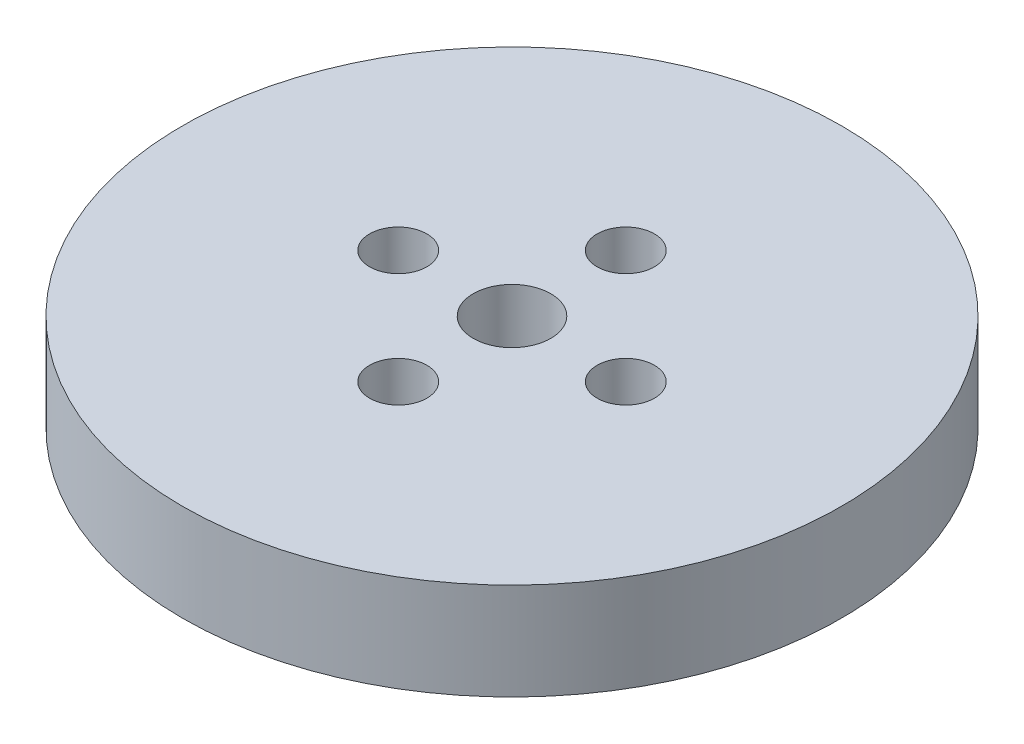
ISO-10303-21;
HEADER;
FILE_DESCRIPTION(('STEP AP214'),'2;1');
FILE_NAME('part.step','',(''),(''),'','','');
FILE_SCHEMA(('AUTOMOTIVE_DESIGN { 1 0 10303 214 1 1 1 1 }'));
ENDSEC;
DATA;
#1=APPLICATION_CONTEXT('core data for automotive mechanical design processes');
#2=APPLICATION_PROTOCOL_DEFINITION('international standard','automotive_design',2000,#1);
#3=PRODUCT_CONTEXT('',#1,'mechanical');
#4=PRODUCT('Part','Part','',(#3));
#5=PRODUCT_RELATED_PRODUCT_CATEGORY('part','',(#4));
#6=PRODUCT_DEFINITION_FORMATION('','',#4);
#7=PRODUCT_DEFINITION_CONTEXT('part definition',#1,'design');
#8=PRODUCT_DEFINITION('design','',#6,#7);
#9=PRODUCT_DEFINITION_SHAPE('','',#8);
#10=(LENGTH_UNIT() NAMED_UNIT(*) SI_UNIT(.MILLI.,.METRE.));
#11=(NAMED_UNIT(*) PLANE_ANGLE_UNIT() SI_UNIT($,.RADIAN.));
#12=(NAMED_UNIT(*) SI_UNIT($,.STERADIAN.) SOLID_ANGLE_UNIT());
#13=UNCERTAINTY_MEASURE_WITH_UNIT(LENGTH_MEASURE(1.E-05),#10,'distance_accuracy_value','');
#14=(GEOMETRIC_REPRESENTATION_CONTEXT(3) GLOBAL_UNCERTAINTY_ASSIGNED_CONTEXT((#13)) GLOBAL_UNIT_ASSIGNED_CONTEXT((#10,
#11,#12)) REPRESENTATION_CONTEXT('',''));
#15=CARTESIAN_POINT('',(0.,0.,0.));
#16=DIRECTION('',(0.,0.,1.));
#17=DIRECTION('',(1.,0.,0.));
#18=AXIS2_PLACEMENT_3D('',#15,#16,#17);
#19=CARTESIAN_POINT('',(0.,25.,0.));
#20=DIRECTION('',(0.,-1.,0.));
#21=DIRECTION('',(0.,0.,-1.));
#22=AXIS2_PLACEMENT_3D('',#19,#20,#21);
#23=CYLINDRICAL_SURFACE('',#22,85.);
#24=CARTESIAN_POINT('',(0.,25.,0.));
#25=DIRECTION('',(0.,1.,0.));
#26=DIRECTION('',(0.,0.,1.));
#27=AXIS2_PLACEMENT_3D('',#24,#25,#26);
#28=CIRCLE('',#27,85.);
#29=CARTESIAN_POINT('',(0.,25.,85.));
#30=VERTEX_POINT('',#29);
#31=EDGE_CURVE('E10',#30,#30,#28,.T.);
#32=ORIENTED_EDGE('',*,*,#31,.F.);
#33=EDGE_LOOP('',(#32));
#34=FACE_BOUND('',#33,.T.);
#35=CARTESIAN_POINT('',(0.,0.,0.));
#36=DIRECTION('',(0.,1.,0.));
#37=DIRECTION('',(0.,0.,1.));
#38=AXIS2_PLACEMENT_3D('',#35,#36,#37);
#39=CIRCLE('',#38,85.);
#40=CARTESIAN_POINT('',(0.,0.,85.));
#41=VERTEX_POINT('',#40);
#42=EDGE_CURVE('E37',#41,#41,#39,.T.);
#43=ORIENTED_EDGE('',*,*,#42,.T.);
#44=EDGE_LOOP('',(#43));
#45=FACE_BOUND('',#44,.T.);
#46=ADVANCED_FACE('F40',(#34,#45),#23,.T.);
#47=CARTESIAN_POINT('',(0.,25.,0.));
#48=DIRECTION('',(0.,1.,0.));
#49=DIRECTION('',(0.,0.,1.));
#50=AXIS2_PLACEMENT_3D('',#47,#48,#49);
#51=PLANE('',#50);
#52=CARTESIAN_POINT('',(1.02462847315425E-13,25.,29.3465258357574));
#53=DIRECTION('',(0.,1.,0.));
#54=DIRECTION('',(1.,0.,0.));
#55=AXIS2_PLACEMENT_3D('',#52,#53,#54);
#56=CIRCLE('',#55,7.38068073508787);
#57=CARTESIAN_POINT('',(7.38068073508797,25.,29.3465258357574));
#58=VERTEX_POINT('',#57);
#59=EDGE_CURVE('E71',#58,#58,#56,.T.);
#60=ORIENTED_EDGE('',*,*,#59,.F.);
#61=EDGE_LOOP('',(#60));
#62=FACE_BOUND('',#61,.T.);
#63=CARTESIAN_POINT('',(29.3465258357574,25.,0.));
#64=DIRECTION('',(0.,1.,0.));
#65=DIRECTION('',(0.,0.,-1.));
#66=AXIS2_PLACEMENT_3D('',#63,#64,#65);
#67=CIRCLE('',#66,7.38068073508787);
#68=CARTESIAN_POINT('',(29.3465258357574,25.,-7.38068073508787));
#69=VERTEX_POINT('',#68);
#70=EDGE_CURVE('E70',#69,#69,#67,.T.);
#71=ORIENTED_EDGE('',*,*,#70,.F.);
#72=EDGE_LOOP('',(#71));
#73=FACE_BOUND('',#72,.T.);
#74=CARTESIAN_POINT('',(-3.07388541946275E-13,25.,-29.3465258357574));
#75=DIRECTION('',(0.,1.,0.));
#76=DIRECTION('',(-1.,0.,0.));
#77=AXIS2_PLACEMENT_3D('',#74,#75,#76);
#78=CIRCLE('',#77,7.38068073508787);
#79=CARTESIAN_POINT('',(-7.38068073508818,25.,-29.3465258357573));
#80=VERTEX_POINT('',#79);
#81=EDGE_CURVE('E61',#80,#80,#78,.T.);
#82=ORIENTED_EDGE('',*,*,#81,.F.);
#83=EDGE_LOOP('',(#82));
#84=FACE_BOUND('',#83,.T.);
#85=CARTESIAN_POINT('',(-29.3465258357574,25.,0.));
#86=DIRECTION('',(0.,1.,0.));
#87=DIRECTION('',(0.,0.,1.));
#88=AXIS2_PLACEMENT_3D('',#85,#86,#87);
#89=CIRCLE('',#88,7.38068073508787);
#90=CARTESIAN_POINT('',(-29.3465258357574,25.,7.38068073508787));
#91=VERTEX_POINT('',#90);
#92=EDGE_CURVE('E54',#91,#91,#89,.T.);
#93=ORIENTED_EDGE('',*,*,#92,.F.);
#94=EDGE_LOOP('',(#93));
#95=FACE_BOUND('',#94,.T.);
#96=CARTESIAN_POINT('',(0.,25.,0.));
#97=DIRECTION('',(0.,1.,0.));
#98=DIRECTION('',(0.,0.,1.));
#99=AXIS2_PLACEMENT_3D('',#96,#97,#98);
#100=CIRCLE('',#99,10.);
#101=CARTESIAN_POINT('',(0.,25.,10.));
#102=VERTEX_POINT('',#101);
#103=EDGE_CURVE('E50',#102,#102,#100,.T.);
#104=ORIENTED_EDGE('',*,*,#103,.F.);
#105=EDGE_LOOP('',(#104));
#106=FACE_BOUND('',#105,.T.);
#107=ORIENTED_EDGE('',*,*,#31,.T.);
#108=EDGE_LOOP('',(#107));
#109=FACE_BOUND('',#108,.T.);
#110=ADVANCED_FACE('F86',(#62,#73,#84,#95,#106,#109),#51,.T.);
#111=CARTESIAN_POINT('',(0.,0.,0.));
#112=DIRECTION('',(0.,1.,0.));
#113=DIRECTION('',(0.,0.,1.));
#114=AXIS2_PLACEMENT_3D('',#111,#112,#113);
#115=PLANE('',#114);
#116=CARTESIAN_POINT('',(0.,0.,0.));
#117=DIRECTION('',(0.,1.,0.));
#118=DIRECTION('',(0.,0.,1.));
#119=AXIS2_PLACEMENT_3D('',#116,#117,#118);
#120=CIRCLE('',#119,10.);
#121=CARTESIAN_POINT('',(0.,0.,10.));
#122=VERTEX_POINT('',#121);
#123=EDGE_CURVE('E47',#122,#122,#120,.T.);
#124=ORIENTED_EDGE('',*,*,#123,.T.);
#125=EDGE_LOOP('',(#124));
#126=FACE_BOUND('',#125,.T.);
#127=ORIENTED_EDGE('',*,*,#42,.F.);
#128=EDGE_LOOP('',(#127));
#129=FACE_BOUND('',#128,.T.);
#130=ADVANCED_FACE('F93',(#126,#129),#115,.F.);
#131=CARTESIAN_POINT('',(0.,25.,0.));
#132=DIRECTION('',(0.,-1.,0.));
#133=DIRECTION('',(0.,0.,-1.));
#134=AXIS2_PLACEMENT_3D('',#131,#132,#133);
#135=CYLINDRICAL_SURFACE('',#134,10.);
#136=ORIENTED_EDGE('',*,*,#103,.T.);
#137=EDGE_LOOP('',(#136));
#138=FACE_BOUND('',#137,.T.);
#139=ORIENTED_EDGE('',*,*,#123,.F.);
#140=EDGE_LOOP('',(#139));
#141=FACE_BOUND('',#140,.T.);
#142=ADVANCED_FACE('F101',(#138,#141),#135,.F.);
#143=CARTESIAN_POINT('',(-29.3465258357574,2.37967551588838,0.));
#144=DIRECTION('',(0.,1.,0.));
#145=DIRECTION('',(0.,0.,1.));
#146=AXIS2_PLACEMENT_3D('',#143,#144,#145);
#147=CYLINDRICAL_SURFACE('',#146,7.38068073508787);
#148=CARTESIAN_POINT('',(-29.3465258357574,2.37967551588838,0.));
#149=DIRECTION('',(0.,1.,0.));
#150=DIRECTION('',(0.,0.,1.));
#151=AXIS2_PLACEMENT_3D('',#148,#149,#150);
#152=CIRCLE('',#151,7.38068073508787);
#153=CARTESIAN_POINT('',(-29.3465258357574,2.37967551588838,7.38068073508787));
#154=VERTEX_POINT('',#153);
#155=EDGE_CURVE('E55',#154,#154,#152,.T.);
#156=ORIENTED_EDGE('',*,*,#155,.F.);
#157=EDGE_LOOP('',(#156));
#158=FACE_BOUND('',#157,.T.);
#159=ORIENTED_EDGE('',*,*,#92,.T.);
#160=EDGE_LOOP('',(#159));
#161=FACE_BOUND('',#160,.T.);
#162=ADVANCED_FACE('F102',(#158,#161),#147,.F.);
#163=CARTESIAN_POINT('',(-29.3465258357574,2.37967551588838,0.));
#164=DIRECTION('',(0.,1.,0.));
#165=DIRECTION('',(0.,0.,1.));
#166=AXIS2_PLACEMENT_3D('',#163,#164,#165);
#167=PLANE('',#166);
#168=ORIENTED_EDGE('',*,*,#155,.T.);
#169=EDGE_LOOP('',(#168));
#170=FACE_BOUND('',#169,.T.);
#171=ADVANCED_FACE('F133',(#170),#167,.T.);
#172=CARTESIAN_POINT('',(-3.07388541946275E-13,2.37967551588838,-29.3465258357574));
#173=DIRECTION('',(0.,1.,0.));
#174=DIRECTION('',(0.,0.,1.));
#175=AXIS2_PLACEMENT_3D('',#172,#173,#174);
#176=CYLINDRICAL_SURFACE('',#175,7.38068073508787);
#177=CARTESIAN_POINT('',(-3.07388541946275E-13,2.37967551588838,-29.3465258357574));
#178=DIRECTION('',(0.,1.,0.));
#179=DIRECTION('',(-1.,0.,0.));
#180=AXIS2_PLACEMENT_3D('',#177,#178,#179);
#181=CIRCLE('',#180,7.38068073508787);
#182=CARTESIAN_POINT('',(-7.38068073508818,2.37967551588838,-29.3465258357573));
#183=VERTEX_POINT('',#182);
#184=EDGE_CURVE('E63',#183,#183,#181,.T.);
#185=ORIENTED_EDGE('',*,*,#184,.F.);
#186=EDGE_LOOP('',(#185));
#187=FACE_BOUND('',#186,.T.);
#188=ORIENTED_EDGE('',*,*,#81,.T.);
#189=EDGE_LOOP('',(#188));
#190=FACE_BOUND('',#189,.T.);
#191=ADVANCED_FACE('F142',(#187,#190),#176,.F.);
#192=CARTESIAN_POINT('',(-3.07388541946275E-13,2.37967551588838,-29.3465258357574));
#193=DIRECTION('',(0.,1.,0.));
#194=DIRECTION('',(-1.,0.,0.));
#195=AXIS2_PLACEMENT_3D('',#192,#193,#194);
#196=PLANE('',#195);
#197=ORIENTED_EDGE('',*,*,#184,.T.);
#198=EDGE_LOOP('',(#197));
#199=FACE_BOUND('',#198,.T.);
#200=ADVANCED_FACE('F156',(#199),#196,.T.);
#201=CARTESIAN_POINT('',(29.3465258357574,2.37967551588838,0.));
#202=DIRECTION('',(0.,1.,0.));
#203=DIRECTION('',(0.,0.,1.));
#204=AXIS2_PLACEMENT_3D('',#201,#202,#203);
#205=CYLINDRICAL_SURFACE('',#204,7.38068073508787);
#206=CARTESIAN_POINT('',(29.3465258357574,2.37967551588838,0.));
#207=DIRECTION('',(0.,1.,0.));
#208=DIRECTION('',(0.,0.,-1.));
#209=AXIS2_PLACEMENT_3D('',#206,#207,#208);
#210=CIRCLE('',#209,7.38068073508787);
#211=CARTESIAN_POINT('',(29.3465258357574,2.37967551588838,-7.38068073508787));
#212=VERTEX_POINT('',#211);
#213=EDGE_CURVE('E69',#212,#212,#210,.T.);
#214=ORIENTED_EDGE('',*,*,#213,.F.);
#215=EDGE_LOOP('',(#214));
#216=FACE_BOUND('',#215,.T.);
#217=ORIENTED_EDGE('',*,*,#70,.T.);
#218=EDGE_LOOP('',(#217));
#219=FACE_BOUND('',#218,.T.);
#220=ADVANCED_FACE('F164',(#216,#219),#205,.F.);
#221=CARTESIAN_POINT('',(29.3465258357574,2.37967551588838,0.));
#222=DIRECTION('',(0.,1.,0.));
#223=DIRECTION('',(0.,0.,-1.));
#224=AXIS2_PLACEMENT_3D('',#221,#222,#223);
#225=PLANE('',#224);
#226=ORIENTED_EDGE('',*,*,#213,.T.);
#227=EDGE_LOOP('',(#226));
#228=FACE_BOUND('',#227,.T.);
#229=ADVANCED_FACE('F83',(#228),#225,.T.);
#230=CARTESIAN_POINT('',(1.02462847315425E-13,2.37967551588838,29.3465258357574));
#231=DIRECTION('',(0.,1.,0.));
#232=DIRECTION('',(0.,0.,1.));
#233=AXIS2_PLACEMENT_3D('',#230,#231,#232);
#234=CYLINDRICAL_SURFACE('',#233,7.38068073508787);
#235=CARTESIAN_POINT('',(1.02462847315425E-13,2.37967551588838,29.3465258357574));
#236=DIRECTION('',(0.,1.,0.));
#237=DIRECTION('',(1.,0.,0.));
#238=AXIS2_PLACEMENT_3D('',#235,#236,#237);
#239=CIRCLE('',#238,7.38068073508787);
#240=CARTESIAN_POINT('',(7.38068073508797,2.37967551588838,29.3465258357574));
#241=VERTEX_POINT('',#240);
#242=EDGE_CURVE('E59',#241,#241,#239,.T.);
#243=ORIENTED_EDGE('',*,*,#242,.F.);
#244=EDGE_LOOP('',(#243));
#245=FACE_BOUND('',#244,.T.);
#246=ORIENTED_EDGE('',*,*,#59,.T.);
#247=EDGE_LOOP('',(#246));
#248=FACE_BOUND('',#247,.T.);
#249=ADVANCED_FACE('F81',(#245,#248),#234,.F.);
#250=CARTESIAN_POINT('',(1.02462847315425E-13,2.37967551588838,29.3465258357574));
#251=DIRECTION('',(0.,1.,0.));
#252=DIRECTION('',(1.,0.,0.));
#253=AXIS2_PLACEMENT_3D('',#250,#251,#252);
#254=PLANE('',#253);
#255=ORIENTED_EDGE('',*,*,#242,.T.);
#256=EDGE_LOOP('',(#255));
#257=FACE_BOUND('',#256,.T.);
#258=ADVANCED_FACE('F78',(#257),#254,.T.);
#259=CLOSED_SHELL('',(#46,#110,#130,#142,#162,#171,#191,#200,#220,#229,#249,#258));
#260=MANIFOLD_SOLID_BREP('B2',#259);
#261=ADVANCED_BREP_SHAPE_REPRESENTATION('',(#18,#260),#14);
#262=SHAPE_DEFINITION_REPRESENTATION(#9,#261);
ENDSEC;
END-ISO-10303-21;
